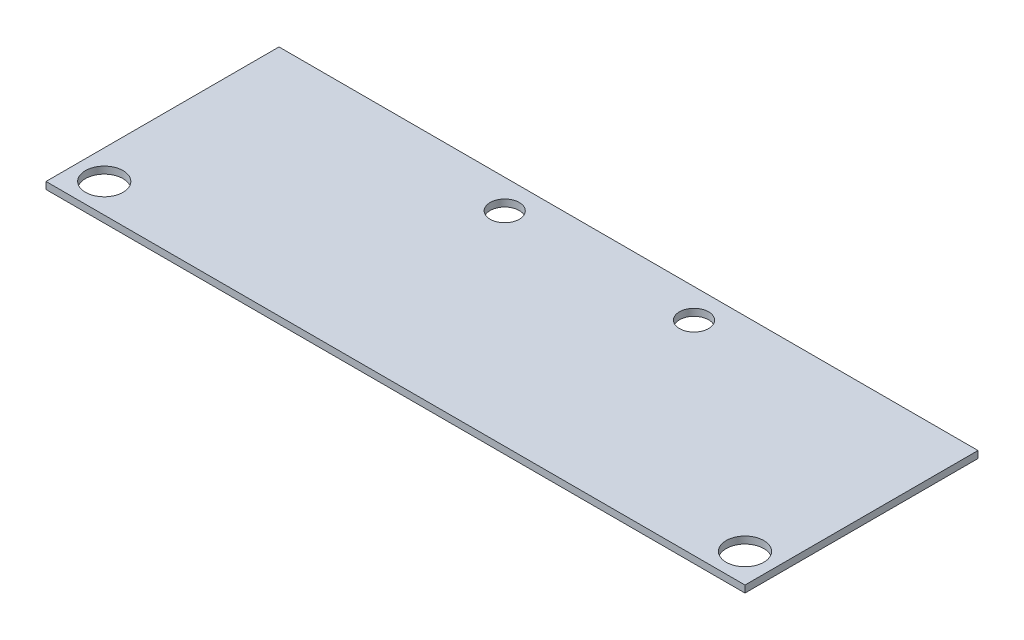
ISO-10303-21;
HEADER;
FILE_DESCRIPTION(('STEP AP214'),'2;1');
FILE_NAME('part.step','',(''),(''),'','','');
FILE_SCHEMA(('AUTOMOTIVE_DESIGN { 1 0 10303 214 1 1 1 1 }'));
ENDSEC;
DATA;
#1=APPLICATION_CONTEXT('core data for automotive mechanical design processes');
#2=APPLICATION_PROTOCOL_DEFINITION('international standard','automotive_design',2000,#1);
#3=PRODUCT_CONTEXT('',#1,'mechanical');
#4=PRODUCT('Part','Part','',(#3));
#5=PRODUCT_RELATED_PRODUCT_CATEGORY('part','',(#4));
#6=PRODUCT_DEFINITION_FORMATION('','',#4);
#7=PRODUCT_DEFINITION_CONTEXT('part definition',#1,'design');
#8=PRODUCT_DEFINITION('design','',#6,#7);
#9=PRODUCT_DEFINITION_SHAPE('','',#8);
#10=(LENGTH_UNIT() NAMED_UNIT(*) SI_UNIT(.MILLI.,.METRE.));
#11=(NAMED_UNIT(*) PLANE_ANGLE_UNIT() SI_UNIT($,.RADIAN.));
#12=(NAMED_UNIT(*) SI_UNIT($,.STERADIAN.) SOLID_ANGLE_UNIT());
#13=UNCERTAINTY_MEASURE_WITH_UNIT(LENGTH_MEASURE(1.E-05),#10,'distance_accuracy_value','');
#14=(GEOMETRIC_REPRESENTATION_CONTEXT(3) GLOBAL_UNCERTAINTY_ASSIGNED_CONTEXT((#13)) GLOBAL_UNIT_ASSIGNED_CONTEXT((#10,
#11,#12)) REPRESENTATION_CONTEXT('',''));
#15=CARTESIAN_POINT('',(0.,0.,0.));
#16=DIRECTION('',(0.,0.,1.));
#17=DIRECTION('',(1.,0.,0.));
#18=AXIS2_PLACEMENT_3D('',#15,#16,#17);
#19=CARTESIAN_POINT('',(-50.2215900326514,1.524,-5.69226056324169));
#20=DIRECTION('',(1.,0.,0.));
#21=DIRECTION('',(0.,0.,-1.));
#22=AXIS2_PLACEMENT_3D('',#19,#20,#21);
#23=PLANE('',#22);
#24=DIRECTION('',(0.,0.,1.));
#25=VECTOR('',#24,1.);
#26=CARTESIAN_POINT('',(-50.2215900326514,0.,-5.69226056324169));
#27=LINE('',#26,#25);
#28=CARTESIAN_POINT('',(-50.2215900326514,0.,-5.69226056324169));
#29=VERTEX_POINT('',#28);
#30=CARTESIAN_POINT('',(-50.2215900326514,0.,45.1077394367583));
#31=VERTEX_POINT('',#30);
#32=EDGE_CURVE('E114',#29,#31,#27,.T.);
#33=ORIENTED_EDGE('',*,*,#32,.T.);
#34=DIRECTION('',(0.,-1.,0.));
#35=VECTOR('',#34,1.);
#36=CARTESIAN_POINT('',(-50.2215900326514,1.524,45.1077394367583));
#37=LINE('',#36,#35);
#38=CARTESIAN_POINT('',(-50.2215900326514,1.524,45.1077394367583));
#39=VERTEX_POINT('',#38);
#40=EDGE_CURVE('E11',#39,#31,#37,.T.);
#41=ORIENTED_EDGE('',*,*,#40,.F.);
#42=DIRECTION('',(0.,0.,1.));
#43=VECTOR('',#42,1.);
#44=CARTESIAN_POINT('',(-50.2215900326514,1.524,-5.69226056324169));
#45=LINE('',#44,#43);
#46=CARTESIAN_POINT('',(-50.2215900326514,1.524,-5.69226056324169));
#47=VERTEX_POINT('',#46);
#48=EDGE_CURVE('E96',#47,#39,#45,.T.);
#49=ORIENTED_EDGE('',*,*,#48,.F.);
#50=DIRECTION('',(0.,-1.,0.));
#51=VECTOR('',#50,1.);
#52=CARTESIAN_POINT('',(-50.2215900326514,1.524,-5.69226056324169));
#53=LINE('',#52,#51);
#54=EDGE_CURVE('E110',#47,#29,#53,.T.);
#55=ORIENTED_EDGE('',*,*,#54,.T.);
#56=EDGE_LOOP('',(#33,#41,#49,#55));
#57=FACE_BOUND('',#56,.T.);
#58=ADVANCED_FACE('F45',(#57),#23,.F.);
#59=CARTESIAN_POINT('',(-50.2215900326514,1.524,45.1077394367583));
#60=DIRECTION('',(0.,0.,-1.));
#61=DIRECTION('',(-1.,0.,0.));
#62=AXIS2_PLACEMENT_3D('',#59,#60,#61);
#63=PLANE('',#62);
#64=DIRECTION('',(1.,0.,0.));
#65=VECTOR('',#64,1.);
#66=CARTESIAN_POINT('',(-50.2215900326514,0.,45.1077394367583));
#67=LINE('',#66,#65);
#68=CARTESIAN_POINT('',(102.178409967349,0.,45.1077394367583));
#69=VERTEX_POINT('',#68);
#70=EDGE_CURVE('E102',#31,#69,#67,.T.);
#71=ORIENTED_EDGE('',*,*,#70,.T.);
#72=DIRECTION('',(0.,-1.,0.));
#73=VECTOR('',#72,1.);
#74=CARTESIAN_POINT('',(102.178409967349,1.524,45.1077394367583));
#75=LINE('',#74,#73);
#76=CARTESIAN_POINT('',(102.178409967349,1.524,45.1077394367583));
#77=VERTEX_POINT('',#76);
#78=EDGE_CURVE('E54',#77,#69,#75,.T.);
#79=ORIENTED_EDGE('',*,*,#78,.F.);
#80=DIRECTION('',(1.,0.,0.));
#81=VECTOR('',#80,1.);
#82=CARTESIAN_POINT('',(-50.2215900326514,1.524,45.1077394367583));
#83=LINE('',#82,#81);
#84=EDGE_CURVE('E90',#39,#77,#83,.T.);
#85=ORIENTED_EDGE('',*,*,#84,.F.);
#86=ORIENTED_EDGE('',*,*,#40,.T.);
#87=EDGE_LOOP('',(#71,#79,#85,#86));
#88=FACE_BOUND('',#87,.T.);
#89=ADVANCED_FACE('F101',(#88),#63,.F.);
#90=CARTESIAN_POINT('',(102.178409967349,1.524,45.1077394367583));
#91=DIRECTION('',(-1.,0.,0.));
#92=DIRECTION('',(0.,0.,1.));
#93=AXIS2_PLACEMENT_3D('',#90,#91,#92);
#94=PLANE('',#93);
#95=DIRECTION('',(0.,0.,-1.));
#96=VECTOR('',#95,1.);
#97=CARTESIAN_POINT('',(102.178409967349,0.,45.1077394367583));
#98=LINE('',#97,#96);
#99=CARTESIAN_POINT('',(102.178409967349,0.,-5.69226056324169));
#100=VERTEX_POINT('',#99);
#101=EDGE_CURVE('E121',#69,#100,#98,.T.);
#102=ORIENTED_EDGE('',*,*,#101,.T.);
#103=DIRECTION('',(0.,-1.,0.));
#104=VECTOR('',#103,1.);
#105=CARTESIAN_POINT('',(102.178409967349,1.524,-5.69226056324169));
#106=LINE('',#105,#104);
#107=CARTESIAN_POINT('',(102.178409967349,1.524,-5.69226056324169));
#108=VERTEX_POINT('',#107);
#109=EDGE_CURVE('E105',#108,#100,#106,.T.);
#110=ORIENTED_EDGE('',*,*,#109,.F.);
#111=DIRECTION('',(0.,0.,-1.));
#112=VECTOR('',#111,1.);
#113=CARTESIAN_POINT('',(102.178409967349,1.524,45.1077394367583));
#114=LINE('',#113,#112);
#115=EDGE_CURVE('E93',#77,#108,#114,.T.);
#116=ORIENTED_EDGE('',*,*,#115,.F.);
#117=ORIENTED_EDGE('',*,*,#78,.T.);
#118=EDGE_LOOP('',(#102,#110,#116,#117));
#119=FACE_BOUND('',#118,.T.);
#120=ADVANCED_FACE('F106',(#119),#94,.F.);
#121=CARTESIAN_POINT('',(0.578409967348606,1.524,-5.69226056324169));
#122=DIRECTION('',(0.,0.,1.));
#123=DIRECTION('',(1.,0.,0.));
#124=AXIS2_PLACEMENT_3D('',#121,#122,#123);
#125=PLANE('',#124);
#126=DIRECTION('',(-1.,0.,0.));
#127=VECTOR('',#126,1.);
#128=CARTESIAN_POINT('',(0.578409967348606,0.,-5.69226056324169));
#129=LINE('',#128,#127);
#130=EDGE_CURVE('E79',#100,#29,#129,.T.);
#131=ORIENTED_EDGE('',*,*,#130,.T.);
#132=ORIENTED_EDGE('',*,*,#54,.F.);
#133=DIRECTION('',(-1.,0.,0.));
#134=VECTOR('',#133,1.);
#135=CARTESIAN_POINT('',(102.178409967349,1.524,-5.69226056324169));
#136=LINE('',#135,#134);
#137=EDGE_CURVE('E62',#108,#47,#136,.T.);
#138=ORIENTED_EDGE('',*,*,#137,.F.);
#139=ORIENTED_EDGE('',*,*,#109,.T.);
#140=EDGE_LOOP('',(#131,#132,#138,#139));
#141=FACE_BOUND('',#140,.T.);
#142=ADVANCED_FACE('F129',(#141),#125,.F.);
#143=CARTESIAN_POINT('',(0.,1.524,0.));
#144=DIRECTION('',(0.,1.,0.));
#145=DIRECTION('',(0.,0.,1.));
#146=AXIS2_PLACEMENT_3D('',#143,#144,#145);
#147=PLANE('',#146);
#148=CARTESIAN_POINT('',(-43.8715900326514,1.524,38.7577394367583));
#149=DIRECTION('',(0.,1.,0.));
#150=DIRECTION('',(0.,0.,1.));
#151=AXIS2_PLACEMENT_3D('',#148,#149,#150);
#152=CIRCLE('',#151,4.1021);
#153=CARTESIAN_POINT('',(-43.8715900326514,1.524,42.8598394367583));
#154=VERTEX_POINT('',#153);
#155=EDGE_CURVE('E157',#154,#154,#152,.T.);
#156=ORIENTED_EDGE('',*,*,#155,.F.);
#157=EDGE_LOOP('',(#156));
#158=FACE_BOUND('',#157,.T.);
#159=CARTESIAN_POINT('',(95.8284099673486,1.524,38.7577394367583));
#160=DIRECTION('',(0.,1.,0.));
#161=DIRECTION('',(0.,0.,1.));
#162=AXIS2_PLACEMENT_3D('',#159,#160,#161);
#163=CIRCLE('',#162,4.10209999999999);
#164=CARTESIAN_POINT('',(95.8284099673486,1.524,42.8598394367583));
#165=VERTEX_POINT('',#164);
#166=EDGE_CURVE('E153',#165,#165,#163,.T.);
#167=ORIENTED_EDGE('',*,*,#166,.F.);
#168=EDGE_LOOP('',(#167));
#169=FACE_BOUND('',#168,.T.);
#170=CARTESIAN_POINT('',(46.6159099673486,1.524,0.657739436758306));
#171=DIRECTION('',(0.,1.,0.));
#172=DIRECTION('',(0.,0.,1.));
#173=AXIS2_PLACEMENT_3D('',#170,#171,#172);
#174=CIRCLE('',#173,3.175);
#175=CARTESIAN_POINT('',(46.6159099673486,1.524,3.8327394367583));
#176=VERTEX_POINT('',#175);
#177=EDGE_CURVE('E145',#176,#176,#174,.T.);
#178=ORIENTED_EDGE('',*,*,#177,.F.);
#179=EDGE_LOOP('',(#178));
#180=FACE_BOUND('',#179,.T.);
#181=CARTESIAN_POINT('',(5.34090996734861,1.524,0.657739436758306));
#182=DIRECTION('',(0.,1.,0.));
#183=DIRECTION('',(0.,0.,1.));
#184=AXIS2_PLACEMENT_3D('',#181,#182,#183);
#185=CIRCLE('',#184,3.175);
#186=CARTESIAN_POINT('',(5.34090996734861,1.524,3.83273943675831));
#187=VERTEX_POINT('',#186);
#188=EDGE_CURVE('E137',#187,#187,#185,.T.);
#189=ORIENTED_EDGE('',*,*,#188,.F.);
#190=EDGE_LOOP('',(#189));
#191=FACE_BOUND('',#190,.T.);
#192=ORIENTED_EDGE('',*,*,#48,.T.);
#193=ORIENTED_EDGE('',*,*,#84,.T.);
#194=ORIENTED_EDGE('',*,*,#115,.T.);
#195=ORIENTED_EDGE('',*,*,#137,.T.);
#196=EDGE_LOOP('',(#192,#193,#194,#195));
#197=FACE_BOUND('',#196,.T.);
#198=ADVANCED_FACE('F91',(#158,#169,#180,#191,#197),#147,.T.);
#199=CARTESIAN_POINT('',(0.,0.,0.));
#200=DIRECTION('',(0.,1.,0.));
#201=DIRECTION('',(0.,0.,1.));
#202=AXIS2_PLACEMENT_3D('',#199,#200,#201);
#203=PLANE('',#202);
#204=CARTESIAN_POINT('',(-43.8715900326514,0.,38.7577394367583));
#205=DIRECTION('',(0.,1.,0.));
#206=DIRECTION('',(0.,0.,1.));
#207=AXIS2_PLACEMENT_3D('',#204,#205,#206);
#208=CIRCLE('',#207,4.1021);
#209=CARTESIAN_POINT('',(-43.8715900326514,0.,42.8598394367583));
#210=VERTEX_POINT('',#209);
#211=EDGE_CURVE('E118',#210,#210,#208,.T.);
#212=ORIENTED_EDGE('',*,*,#211,.T.);
#213=EDGE_LOOP('',(#212));
#214=FACE_BOUND('',#213,.T.);
#215=CARTESIAN_POINT('',(95.8284099673486,0.,38.7577394367583));
#216=DIRECTION('',(0.,1.,0.));
#217=DIRECTION('',(0.,0.,1.));
#218=AXIS2_PLACEMENT_3D('',#215,#216,#217);
#219=CIRCLE('',#218,4.10209999999999);
#220=CARTESIAN_POINT('',(95.8284099673486,0.,42.8598394367583));
#221=VERTEX_POINT('',#220);
#222=EDGE_CURVE('E149',#221,#221,#219,.T.);
#223=ORIENTED_EDGE('',*,*,#222,.T.);
#224=EDGE_LOOP('',(#223));
#225=FACE_BOUND('',#224,.T.);
#226=CARTESIAN_POINT('',(46.6159099673486,0.,0.657739436758306));
#227=DIRECTION('',(0.,1.,0.));
#228=DIRECTION('',(0.,0.,1.));
#229=AXIS2_PLACEMENT_3D('',#226,#227,#228);
#230=CIRCLE('',#229,3.175);
#231=CARTESIAN_POINT('',(46.6159099673486,0.,3.8327394367583));
#232=VERTEX_POINT('',#231);
#233=EDGE_CURVE('E141',#232,#232,#230,.T.);
#234=ORIENTED_EDGE('',*,*,#233,.T.);
#235=EDGE_LOOP('',(#234));
#236=FACE_BOUND('',#235,.T.);
#237=CARTESIAN_POINT('',(5.34090996734861,0.,0.657739436758306));
#238=DIRECTION('',(0.,1.,0.));
#239=DIRECTION('',(0.,0.,1.));
#240=AXIS2_PLACEMENT_3D('',#237,#238,#239);
#241=CIRCLE('',#240,3.175);
#242=CARTESIAN_POINT('',(5.34090996734861,0.,3.83273943675831));
#243=VERTEX_POINT('',#242);
#244=EDGE_CURVE('E133',#243,#243,#241,.T.);
#245=ORIENTED_EDGE('',*,*,#244,.T.);
#246=EDGE_LOOP('',(#245));
#247=FACE_BOUND('',#246,.T.);
#248=ORIENTED_EDGE('',*,*,#32,.F.);
#249=ORIENTED_EDGE('',*,*,#130,.F.);
#250=ORIENTED_EDGE('',*,*,#101,.F.);
#251=ORIENTED_EDGE('',*,*,#70,.F.);
#252=EDGE_LOOP('',(#248,#249,#250,#251));
#253=FACE_BOUND('',#252,.T.);
#254=ADVANCED_FACE('F165',(#214,#225,#236,#247,#253),#203,.F.);
#255=CARTESIAN_POINT('',(5.34090996734861,0.,0.657739436758306));
#256=DIRECTION('',(0.,1.,0.));
#257=DIRECTION('',(0.,0.,1.));
#258=AXIS2_PLACEMENT_3D('',#255,#256,#257);
#259=CYLINDRICAL_SURFACE('',#258,3.175);
#260=ORIENTED_EDGE('',*,*,#244,.F.);
#261=EDGE_LOOP('',(#260));
#262=FACE_BOUND('',#261,.T.);
#263=ORIENTED_EDGE('',*,*,#188,.T.);
#264=EDGE_LOOP('',(#263));
#265=FACE_BOUND('',#264,.T.);
#266=ADVANCED_FACE('F184',(#262,#265),#259,.F.);
#267=CARTESIAN_POINT('',(46.6159099673486,0.,0.657739436758306));
#268=DIRECTION('',(0.,1.,0.));
#269=DIRECTION('',(0.,0.,1.));
#270=AXIS2_PLACEMENT_3D('',#267,#268,#269);
#271=CYLINDRICAL_SURFACE('',#270,3.175);
#272=ORIENTED_EDGE('',*,*,#233,.F.);
#273=EDGE_LOOP('',(#272));
#274=FACE_BOUND('',#273,.T.);
#275=ORIENTED_EDGE('',*,*,#177,.T.);
#276=EDGE_LOOP('',(#275));
#277=FACE_BOUND('',#276,.T.);
#278=ADVANCED_FACE('F186',(#274,#277),#271,.F.);
#279=CARTESIAN_POINT('',(95.8284099673486,0.,38.7577394367583));
#280=DIRECTION('',(0.,1.,0.));
#281=DIRECTION('',(0.,0.,1.));
#282=AXIS2_PLACEMENT_3D('',#279,#280,#281);
#283=CYLINDRICAL_SURFACE('',#282,4.10209999999999);
#284=ORIENTED_EDGE('',*,*,#222,.F.);
#285=EDGE_LOOP('',(#284));
#286=FACE_BOUND('',#285,.T.);
#287=ORIENTED_EDGE('',*,*,#166,.T.);
#288=EDGE_LOOP('',(#287));
#289=FACE_BOUND('',#288,.T.);
#290=ADVANCED_FACE('F171',(#286,#289),#283,.F.);
#291=CARTESIAN_POINT('',(-43.8715900326514,0.,38.7577394367583));
#292=DIRECTION('',(0.,1.,0.));
#293=DIRECTION('',(0.,0.,1.));
#294=AXIS2_PLACEMENT_3D('',#291,#292,#293);
#295=CYLINDRICAL_SURFACE('',#294,4.1021);
#296=ORIENTED_EDGE('',*,*,#211,.F.);
#297=EDGE_LOOP('',(#296));
#298=FACE_BOUND('',#297,.T.);
#299=ORIENTED_EDGE('',*,*,#155,.T.);
#300=EDGE_LOOP('',(#299));
#301=FACE_BOUND('',#300,.T.);
#302=ADVANCED_FACE('F168',(#298,#301),#295,.F.);
#303=CLOSED_SHELL('',(#58,#89,#120,#142,#198,#254,#266,#278,#290,#302));
#304=MANIFOLD_SOLID_BREP('B2',#303);
#305=ADVANCED_BREP_SHAPE_REPRESENTATION('',(#18,#304),#14);
#306=SHAPE_DEFINITION_REPRESENTATION(#9,#305);
ENDSEC;
END-ISO-10303-21;
